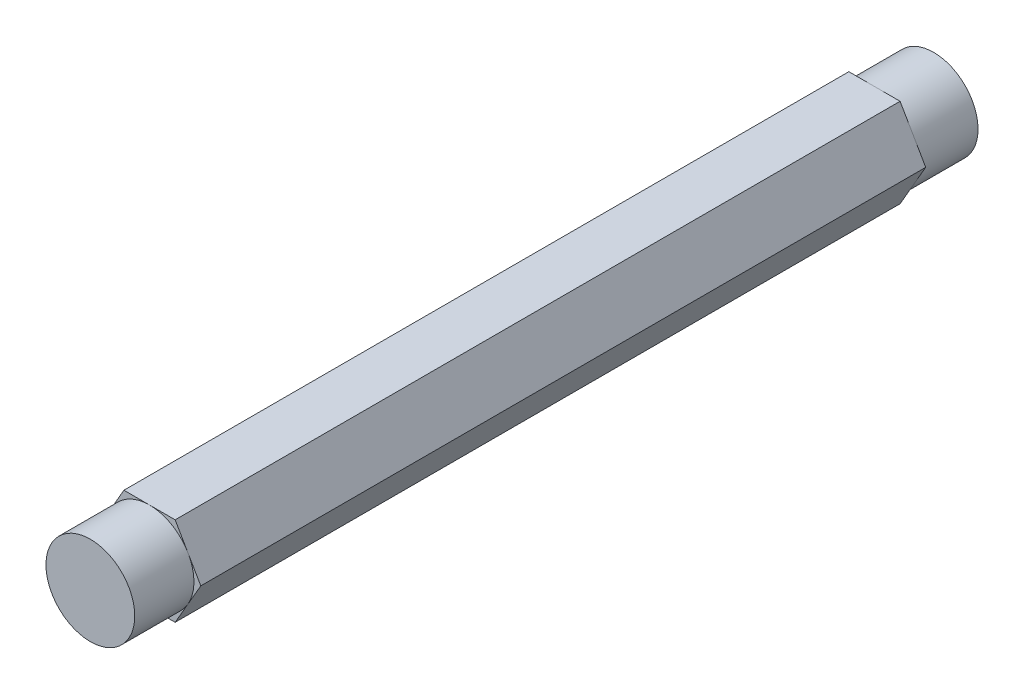
ISO-10303-21;
HEADER;
FILE_DESCRIPTION(('STEP AP214'),'2;1');
FILE_NAME('part.step','',(''),(''),'','','');
FILE_SCHEMA(('AUTOMOTIVE_DESIGN { 1 0 10303 214 1 1 1 1 }'));
ENDSEC;
DATA;
#1=APPLICATION_CONTEXT('core data for automotive mechanical design processes');
#2=APPLICATION_PROTOCOL_DEFINITION('international standard','automotive_design',2000,#1);
#3=PRODUCT_CONTEXT('',#1,'mechanical');
#4=PRODUCT('Part','Part','',(#3));
#5=PRODUCT_RELATED_PRODUCT_CATEGORY('part','',(#4));
#6=PRODUCT_DEFINITION_FORMATION('','',#4);
#7=PRODUCT_DEFINITION_CONTEXT('part definition',#1,'design');
#8=PRODUCT_DEFINITION('design','',#6,#7);
#9=PRODUCT_DEFINITION_SHAPE('','',#8);
#10=(LENGTH_UNIT() NAMED_UNIT(*) SI_UNIT(.MILLI.,.METRE.));
#11=(NAMED_UNIT(*) PLANE_ANGLE_UNIT() SI_UNIT($,.RADIAN.));
#12=(NAMED_UNIT(*) SI_UNIT($,.STERADIAN.) SOLID_ANGLE_UNIT());
#13=UNCERTAINTY_MEASURE_WITH_UNIT(LENGTH_MEASURE(1.E-05),#10,'distance_accuracy_value','');
#14=(GEOMETRIC_REPRESENTATION_CONTEXT(3) GLOBAL_UNCERTAINTY_ASSIGNED_CONTEXT((#13)) GLOBAL_UNIT_ASSIGNED_CONTEXT((#10,
#11,#12)) REPRESENTATION_CONTEXT('',''));
#15=CARTESIAN_POINT('',(0.,0.,0.));
#16=DIRECTION('',(0.,0.,1.));
#17=DIRECTION('',(1.,0.,0.));
#18=AXIS2_PLACEMENT_3D('',#15,#16,#17);
#19=CARTESIAN_POINT('',(0.,0.,0.));
#20=DIRECTION('',(0.,0.,1.));
#21=DIRECTION('',(1.,0.,0.));
#22=AXIS2_PLACEMENT_3D('',#19,#20,#21);
#23=PLANE('',#22);
#24=CARTESIAN_POINT('',(0.,0.,0.));
#25=DIRECTION('',(0.,0.,-1.));
#26=DIRECTION('',(-1.,0.,0.));
#27=AXIS2_PLACEMENT_3D('',#24,#25,#26);
#28=CIRCLE('',#27,4.7625);
#29=CARTESIAN_POINT('',(-4.12444598552339,2.38125,0.));
#30=VERTEX_POINT('',#29);
#31=CARTESIAN_POINT('',(0.,4.7625,0.));
#32=VERTEX_POINT('',#31);
#33=EDGE_CURVE('E46',#30,#32,#28,.T.);
#34=ORIENTED_EDGE('',*,*,#33,.F.);
#35=DIRECTION('',(-0.5,-0.866025403784439,0.));
#36=VECTOR('',#35,1.);
#37=CARTESIAN_POINT('',(-2.74963065701559,4.7625,0.));
#38=LINE('',#37,#36);
#39=CARTESIAN_POINT('',(-2.74963065701559,4.7625,0.));
#40=VERTEX_POINT('',#39);
#41=EDGE_CURVE('E130',#40,#30,#38,.T.);
#42=ORIENTED_EDGE('',*,*,#41,.F.);
#43=DIRECTION('',(-1.,0.,0.));
#44=VECTOR('',#43,1.);
#45=CARTESIAN_POINT('',(2.74963065701559,4.7625,0.));
#46=LINE('',#45,#44);
#47=EDGE_CURVE('E153',#32,#40,#46,.T.);
#48=ORIENTED_EDGE('',*,*,#47,.F.);
#49=EDGE_LOOP('',(#34,#42,#48));
#50=FACE_BOUND('',#49,.T.);
#51=ADVANCED_FACE('F35',(#50),#23,.F.);
#52=CARTESIAN_POINT('',(4.12444598552339,2.38125,0.));
#53=VERTEX_POINT('',#52);
#54=EDGE_CURVE('E11',#32,#53,#28,.T.);
#55=ORIENTED_EDGE('',*,*,#54,.F.);
#56=CARTESIAN_POINT('',(2.74963065701559,4.7625,0.));
#57=VERTEX_POINT('',#56);
#58=EDGE_CURVE('E151',#57,#32,#46,.T.);
#59=ORIENTED_EDGE('',*,*,#58,.F.);
#60=DIRECTION('',(-0.5,0.866025403784439,0.));
#61=VECTOR('',#60,1.);
#62=CARTESIAN_POINT('',(5.49926131403119,0.,0.));
#63=LINE('',#62,#61);
#64=EDGE_CURVE('E203',#53,#57,#63,.T.);
#65=ORIENTED_EDGE('',*,*,#64,.F.);
#66=EDGE_LOOP('',(#55,#59,#65));
#67=FACE_BOUND('',#66,.T.);
#68=ADVANCED_FACE('F246',(#67),#23,.F.);
#69=CARTESIAN_POINT('',(4.12444598552339,-2.38125,0.));
#70=VERTEX_POINT('',#69);
#71=EDGE_CURVE('E44',#53,#70,#28,.T.);
#72=ORIENTED_EDGE('',*,*,#71,.F.);
#73=CARTESIAN_POINT('',(5.49926131403119,0.,0.));
#74=VERTEX_POINT('',#73);
#75=EDGE_CURVE('E204',#74,#53,#63,.T.);
#76=ORIENTED_EDGE('',*,*,#75,.F.);
#77=DIRECTION('',(0.5,0.866025403784439,0.));
#78=VECTOR('',#77,1.);
#79=CARTESIAN_POINT('',(2.74963065701559,-4.7625,0.));
#80=LINE('',#79,#78);
#81=EDGE_CURVE('E199',#70,#74,#80,.T.);
#82=ORIENTED_EDGE('',*,*,#81,.F.);
#83=EDGE_LOOP('',(#72,#76,#82));
#84=FACE_BOUND('',#83,.T.);
#85=ADVANCED_FACE('F250',(#84),#23,.F.);
#86=CARTESIAN_POINT('',(0.,-4.7625,0.));
#87=VERTEX_POINT('',#86);
#88=EDGE_CURVE('E60',#70,#87,#28,.T.);
#89=ORIENTED_EDGE('',*,*,#88,.F.);
#90=CARTESIAN_POINT('',(2.74963065701559,-4.7625,0.));
#91=VERTEX_POINT('',#90);
#92=EDGE_CURVE('E200',#91,#70,#80,.T.);
#93=ORIENTED_EDGE('',*,*,#92,.F.);
#94=DIRECTION('',(1.,0.,0.));
#95=VECTOR('',#94,1.);
#96=CARTESIAN_POINT('',(-2.74963065701559,-4.7625,0.));
#97=LINE('',#96,#95);
#98=EDGE_CURVE('E195',#87,#91,#97,.T.);
#99=ORIENTED_EDGE('',*,*,#98,.F.);
#100=EDGE_LOOP('',(#89,#93,#99));
#101=FACE_BOUND('',#100,.T.);
#102=ADVANCED_FACE('F253',(#101),#23,.F.);
#103=CARTESIAN_POINT('',(-4.12444598552339,-2.38125,0.));
#104=VERTEX_POINT('',#103);
#105=EDGE_CURVE('E53',#87,#104,#28,.T.);
#106=ORIENTED_EDGE('',*,*,#105,.F.);
#107=CARTESIAN_POINT('',(-2.74963065701559,-4.7625,0.));
#108=VERTEX_POINT('',#107);
#109=EDGE_CURVE('E196',#108,#87,#97,.T.);
#110=ORIENTED_EDGE('',*,*,#109,.F.);
#111=DIRECTION('',(0.5,-0.866025403784439,0.));
#112=VECTOR('',#111,1.);
#113=CARTESIAN_POINT('',(-5.49926131403119,0.,0.));
#114=LINE('',#113,#112);
#115=EDGE_CURVE('E167',#104,#108,#114,.T.);
#116=ORIENTED_EDGE('',*,*,#115,.F.);
#117=EDGE_LOOP('',(#106,#110,#116));
#118=FACE_BOUND('',#117,.T.);
#119=ADVANCED_FACE('F255',(#118),#23,.F.);
#120=CARTESIAN_POINT('',(0.,0.,77.7875));
#121=DIRECTION('',(0.,0.,1.));
#122=DIRECTION('',(1.,0.,0.));
#123=AXIS2_PLACEMENT_3D('',#120,#121,#122);
#124=PLANE('',#123);
#125=CARTESIAN_POINT('',(0.,0.,77.7875));
#126=DIRECTION('',(0.,0.,1.));
#127=DIRECTION('',(1.,0.,0.));
#128=AXIS2_PLACEMENT_3D('',#125,#126,#127);
#129=CIRCLE('',#128,4.7625);
#130=CARTESIAN_POINT('',(4.12444598552339,2.38125,77.7875));
#131=VERTEX_POINT('',#130);
#132=CARTESIAN_POINT('',(0.,4.7625,77.7875));
#133=VERTEX_POINT('',#132);
#134=EDGE_CURVE('E162',#131,#133,#129,.T.);
#135=ORIENTED_EDGE('',*,*,#134,.F.);
#136=DIRECTION('',(-0.5,0.866025403784439,0.));
#137=VECTOR('',#136,1.);
#138=CARTESIAN_POINT('',(5.49926131403119,0.,77.7875));
#139=LINE('',#138,#137);
#140=CARTESIAN_POINT('',(2.74963065701559,4.7625,77.7875));
#141=VERTEX_POINT('',#140);
#142=EDGE_CURVE('E182',#131,#141,#139,.T.);
#143=ORIENTED_EDGE('',*,*,#142,.T.);
#144=DIRECTION('',(-1.,0.,0.));
#145=VECTOR('',#144,1.);
#146=CARTESIAN_POINT('',(2.74963065701559,4.7625,77.7875));
#147=LINE('',#146,#145);
#148=EDGE_CURVE('E186',#141,#133,#147,.T.);
#149=ORIENTED_EDGE('',*,*,#148,.T.);
#150=EDGE_LOOP('',(#135,#143,#149));
#151=FACE_BOUND('',#150,.T.);
#152=ADVANCED_FACE('F272',(#151),#124,.T.);
#153=CARTESIAN_POINT('',(-4.12444598552339,2.38125,77.7875));
#154=VERTEX_POINT('',#153);
#155=EDGE_CURVE('E158',#133,#154,#129,.T.);
#156=ORIENTED_EDGE('',*,*,#155,.F.);
#157=CARTESIAN_POINT('',(-2.74963065701559,4.7625,77.7875));
#158=VERTEX_POINT('',#157);
#159=EDGE_CURVE('E185',#133,#158,#147,.T.);
#160=ORIENTED_EDGE('',*,*,#159,.T.);
#161=DIRECTION('',(-0.5,-0.866025403784439,0.));
#162=VECTOR('',#161,1.);
#163=CARTESIAN_POINT('',(-2.74963065701559,4.7625,77.7875));
#164=LINE('',#163,#162);
#165=EDGE_CURVE('E190',#158,#154,#164,.T.);
#166=ORIENTED_EDGE('',*,*,#165,.T.);
#167=EDGE_LOOP('',(#156,#160,#166));
#168=FACE_BOUND('',#167,.T.);
#169=ADVANCED_FACE('F237',(#168),#124,.T.);
#170=CARTESIAN_POINT('',(-4.12444598552339,-2.38125,77.7875));
#171=VERTEX_POINT('',#170);
#172=EDGE_CURVE('E160',#154,#171,#129,.T.);
#173=ORIENTED_EDGE('',*,*,#172,.F.);
#174=CARTESIAN_POINT('',(-5.49926131403119,0.,77.7875));
#175=VERTEX_POINT('',#174);
#176=EDGE_CURVE('E189',#154,#175,#164,.T.);
#177=ORIENTED_EDGE('',*,*,#176,.T.);
#178=DIRECTION('',(0.5,-0.866025403784439,0.));
#179=VECTOR('',#178,1.);
#180=CARTESIAN_POINT('',(-5.49926131403119,0.,77.7875));
#181=LINE('',#180,#179);
#182=EDGE_CURVE('E171',#175,#171,#181,.T.);
#183=ORIENTED_EDGE('',*,*,#182,.T.);
#184=EDGE_LOOP('',(#173,#177,#183));
#185=FACE_BOUND('',#184,.T.);
#186=ADVANCED_FACE('F234',(#185),#124,.T.);
#187=CARTESIAN_POINT('',(0.,-4.7625,77.7875));
#188=VERTEX_POINT('',#187);
#189=EDGE_CURVE('E228',#171,#188,#129,.T.);
#190=ORIENTED_EDGE('',*,*,#189,.F.);
#191=CARTESIAN_POINT('',(-2.74963065701559,-4.7625,77.7875));
#192=VERTEX_POINT('',#191);
#193=EDGE_CURVE('E142',#171,#192,#181,.T.);
#194=ORIENTED_EDGE('',*,*,#193,.T.);
#195=DIRECTION('',(1.,0.,0.));
#196=VECTOR('',#195,1.);
#197=CARTESIAN_POINT('',(-2.74963065701559,-4.7625,77.7875));
#198=LINE('',#197,#196);
#199=EDGE_CURVE('E175',#192,#188,#198,.T.);
#200=ORIENTED_EDGE('',*,*,#199,.T.);
#201=EDGE_LOOP('',(#190,#194,#200));
#202=FACE_BOUND('',#201,.T.);
#203=ADVANCED_FACE('F259',(#202),#124,.T.);
#204=CARTESIAN_POINT('',(4.12444598552339,-2.38125,77.7875));
#205=VERTEX_POINT('',#204);
#206=EDGE_CURVE('E225',#188,#205,#129,.T.);
#207=ORIENTED_EDGE('',*,*,#206,.F.);
#208=CARTESIAN_POINT('',(2.74963065701559,-4.7625,77.7875));
#209=VERTEX_POINT('',#208);
#210=EDGE_CURVE('E174',#188,#209,#198,.T.);
#211=ORIENTED_EDGE('',*,*,#210,.T.);
#212=DIRECTION('',(0.5,0.866025403784439,0.));
#213=VECTOR('',#212,1.);
#214=CARTESIAN_POINT('',(2.74963065701559,-4.7625,77.7875));
#215=LINE('',#214,#213);
#216=EDGE_CURVE('E179',#209,#205,#215,.T.);
#217=ORIENTED_EDGE('',*,*,#216,.T.);
#218=EDGE_LOOP('',(#207,#211,#217));
#219=FACE_BOUND('',#218,.T.);
#220=ADVANCED_FACE('F262',(#219),#124,.T.);
#221=CARTESIAN_POINT('',(-5.49926131403119,0.,77.7875));
#222=DIRECTION('',(0.866025403784439,0.5,0.));
#223=DIRECTION('',(-0.5,0.866025403784439,0.));
#224=AXIS2_PLACEMENT_3D('',#221,#222,#223);
#225=PLANE('',#224);
#226=CARTESIAN_POINT('',(-5.49926131403119,0.,0.));
#227=VERTEX_POINT('',#226);
#228=EDGE_CURVE('E150',#227,#104,#114,.T.);
#229=ORIENTED_EDGE('',*,*,#228,.T.);
#230=ORIENTED_EDGE('',*,*,#115,.T.);
#231=DIRECTION('',(0.,0.,-1.));
#232=VECTOR('',#231,1.);
#233=CARTESIAN_POINT('',(-2.74963065701559,-4.7625,77.7875));
#234=LINE('',#233,#232);
#235=EDGE_CURVE('E39',#192,#108,#234,.T.);
#236=ORIENTED_EDGE('',*,*,#235,.F.);
#237=ORIENTED_EDGE('',*,*,#193,.F.);
#238=ORIENTED_EDGE('',*,*,#182,.F.);
#239=DIRECTION('',(0.,0.,-1.));
#240=VECTOR('',#239,1.);
#241=CARTESIAN_POINT('',(-5.49926131403119,0.,77.7875));
#242=LINE('',#241,#240);
#243=EDGE_CURVE('E193',#175,#227,#242,.T.);
#244=ORIENTED_EDGE('',*,*,#243,.T.);
#245=EDGE_LOOP('',(#229,#230,#236,#237,#238,#244));
#246=FACE_BOUND('',#245,.T.);
#247=ADVANCED_FACE('F37',(#246),#225,.F.);
#248=CARTESIAN_POINT('',(-2.74963065701559,-4.7625,77.7875));
#249=DIRECTION('',(0.,1.,0.));
#250=DIRECTION('',(-1.,0.,0.));
#251=AXIS2_PLACEMENT_3D('',#248,#249,#250);
#252=PLANE('',#251);
#253=ORIENTED_EDGE('',*,*,#109,.T.);
#254=ORIENTED_EDGE('',*,*,#98,.T.);
#255=DIRECTION('',(0.,0.,-1.));
#256=VECTOR('',#255,1.);
#257=CARTESIAN_POINT('',(2.74963065701559,-4.7625,77.7875));
#258=LINE('',#257,#256);
#259=EDGE_CURVE('E215',#209,#91,#258,.T.);
#260=ORIENTED_EDGE('',*,*,#259,.F.);
#261=ORIENTED_EDGE('',*,*,#210,.F.);
#262=ORIENTED_EDGE('',*,*,#199,.F.);
#263=ORIENTED_EDGE('',*,*,#235,.T.);
#264=EDGE_LOOP('',(#253,#254,#260,#261,#262,#263));
#265=FACE_BOUND('',#264,.T.);
#266=ADVANCED_FACE('F254',(#265),#252,.F.);
#267=CARTESIAN_POINT('',(2.74963065701559,-4.7625,77.7875));
#268=DIRECTION('',(-0.866025403784439,0.5,0.));
#269=DIRECTION('',(-0.5,-0.866025403784439,0.));
#270=AXIS2_PLACEMENT_3D('',#267,#268,#269);
#271=PLANE('',#270);
#272=ORIENTED_EDGE('',*,*,#92,.T.);
#273=ORIENTED_EDGE('',*,*,#81,.T.);
#274=DIRECTION('',(0.,0.,-1.));
#275=VECTOR('',#274,1.);
#276=CARTESIAN_POINT('',(5.49926131403119,0.,77.7875));
#277=LINE('',#276,#275);
#278=CARTESIAN_POINT('',(5.49926131403119,0.,77.7875));
#279=VERTEX_POINT('',#278);
#280=EDGE_CURVE('E213',#279,#74,#277,.T.);
#281=ORIENTED_EDGE('',*,*,#280,.F.);
#282=EDGE_CURVE('E178',#205,#279,#215,.T.);
#283=ORIENTED_EDGE('',*,*,#282,.F.);
#284=ORIENTED_EDGE('',*,*,#216,.F.);
#285=ORIENTED_EDGE('',*,*,#259,.T.);
#286=EDGE_LOOP('',(#272,#273,#281,#283,#284,#285));
#287=FACE_BOUND('',#286,.T.);
#288=ADVANCED_FACE('F252',(#287),#271,.F.);
#289=CARTESIAN_POINT('',(5.49926131403119,0.,77.7875));
#290=DIRECTION('',(-0.866025403784439,-0.5,0.));
#291=DIRECTION('',(0.5,-0.866025403784439,0.));
#292=AXIS2_PLACEMENT_3D('',#289,#290,#291);
#293=PLANE('',#292);
#294=ORIENTED_EDGE('',*,*,#75,.T.);
#295=ORIENTED_EDGE('',*,*,#64,.T.);
#296=DIRECTION('',(0.,0.,-1.));
#297=VECTOR('',#296,1.);
#298=CARTESIAN_POINT('',(2.74963065701559,4.7625,77.7875));
#299=LINE('',#298,#297);
#300=EDGE_CURVE('E210',#141,#57,#299,.T.);
#301=ORIENTED_EDGE('',*,*,#300,.F.);
#302=ORIENTED_EDGE('',*,*,#142,.F.);
#303=EDGE_CURVE('E183',#279,#131,#139,.T.);
#304=ORIENTED_EDGE('',*,*,#303,.F.);
#305=ORIENTED_EDGE('',*,*,#280,.T.);
#306=EDGE_LOOP('',(#294,#295,#301,#302,#304,#305));
#307=FACE_BOUND('',#306,.T.);
#308=ADVANCED_FACE('F270',(#307),#293,.F.);
#309=CARTESIAN_POINT('',(2.74963065701559,4.7625,77.7875));
#310=DIRECTION('',(0.,-1.,0.));
#311=DIRECTION('',(1.,0.,0.));
#312=AXIS2_PLACEMENT_3D('',#309,#310,#311);
#313=PLANE('',#312);
#314=ORIENTED_EDGE('',*,*,#58,.T.);
#315=ORIENTED_EDGE('',*,*,#47,.T.);
#316=DIRECTION('',(0.,0.,-1.));
#317=VECTOR('',#316,1.);
#318=CARTESIAN_POINT('',(-2.74963065701559,4.7625,77.7875));
#319=LINE('',#318,#317);
#320=EDGE_CURVE('E138',#158,#40,#319,.T.);
#321=ORIENTED_EDGE('',*,*,#320,.F.);
#322=ORIENTED_EDGE('',*,*,#159,.F.);
#323=ORIENTED_EDGE('',*,*,#148,.F.);
#324=ORIENTED_EDGE('',*,*,#300,.T.);
#325=EDGE_LOOP('',(#314,#315,#321,#322,#323,#324));
#326=FACE_BOUND('',#325,.T.);
#327=ADVANCED_FACE('F241',(#326),#313,.F.);
#328=CARTESIAN_POINT('',(-2.74963065701559,4.7625,77.7875));
#329=DIRECTION('',(0.866025403784439,-0.5,0.));
#330=DIRECTION('',(0.5,0.866025403784439,0.));
#331=AXIS2_PLACEMENT_3D('',#328,#329,#330);
#332=PLANE('',#331);
#333=ORIENTED_EDGE('',*,*,#41,.T.);
#334=EDGE_CURVE('E134',#30,#227,#38,.T.);
#335=ORIENTED_EDGE('',*,*,#334,.T.);
#336=ORIENTED_EDGE('',*,*,#243,.F.);
#337=ORIENTED_EDGE('',*,*,#176,.F.);
#338=ORIENTED_EDGE('',*,*,#165,.F.);
#339=ORIENTED_EDGE('',*,*,#320,.T.);
#340=EDGE_LOOP('',(#333,#335,#336,#337,#338,#339));
#341=FACE_BOUND('',#340,.T.);
#342=ADVANCED_FACE('F132',(#341),#332,.F.);
#343=EDGE_CURVE('E170',#205,#131,#129,.T.);
#344=ORIENTED_EDGE('',*,*,#343,.F.);
#345=ORIENTED_EDGE('',*,*,#282,.T.);
#346=ORIENTED_EDGE('',*,*,#303,.T.);
#347=EDGE_LOOP('',(#344,#345,#346));
#348=FACE_BOUND('',#347,.T.);
#349=ADVANCED_FACE('F266',(#348),#124,.T.);
#350=EDGE_CURVE('E148',#104,#30,#28,.T.);
#351=ORIENTED_EDGE('',*,*,#350,.F.);
#352=ORIENTED_EDGE('',*,*,#228,.F.);
#353=ORIENTED_EDGE('',*,*,#334,.F.);
#354=EDGE_LOOP('',(#351,#352,#353));
#355=FACE_BOUND('',#354,.T.);
#356=ADVANCED_FACE('F146',(#355),#23,.F.);
#357=CARTESIAN_POINT('',(0.,0.,84.1375));
#358=DIRECTION('',(0.,0.,-1.));
#359=DIRECTION('',(-1.,0.,0.));
#360=AXIS2_PLACEMENT_3D('',#357,#358,#359);
#361=CYLINDRICAL_SURFACE('',#360,4.7625);
#362=CARTESIAN_POINT('',(0.,0.,84.1375));
#363=DIRECTION('',(0.,0.,1.));
#364=DIRECTION('',(1.,0.,0.));
#365=AXIS2_PLACEMENT_3D('',#362,#363,#364);
#366=CIRCLE('',#365,4.7625);
#367=CARTESIAN_POINT('',(4.7625,0.,84.1375));
#368=VERTEX_POINT('',#367);
#369=EDGE_CURVE('E165',#368,#368,#366,.T.);
#370=ORIENTED_EDGE('',*,*,#369,.F.);
#371=EDGE_LOOP('',(#370));
#372=FACE_BOUND('',#371,.T.);
#373=ORIENTED_EDGE('',*,*,#134,.T.);
#374=ORIENTED_EDGE('',*,*,#155,.T.);
#375=ORIENTED_EDGE('',*,*,#172,.T.);
#376=ORIENTED_EDGE('',*,*,#189,.T.);
#377=ORIENTED_EDGE('',*,*,#206,.T.);
#378=ORIENTED_EDGE('',*,*,#343,.T.);
#379=EDGE_LOOP('',(#373,#374,#375,#376,#377,#378));
#380=FACE_BOUND('',#379,.T.);
#381=ADVANCED_FACE('F231',(#372,#380),#361,.T.);
#382=CARTESIAN_POINT('',(0.,0.,84.1375));
#383=DIRECTION('',(0.,0.,1.));
#384=DIRECTION('',(1.,0.,0.));
#385=AXIS2_PLACEMENT_3D('',#382,#383,#384);
#386=PLANE('',#385);
#387=ORIENTED_EDGE('',*,*,#369,.T.);
#388=EDGE_LOOP('',(#387));
#389=FACE_BOUND('',#388,.T.);
#390=ADVANCED_FACE('F291',(#389),#386,.T.);
#391=CARTESIAN_POINT('',(0.,0.,-6.35));
#392=DIRECTION('',(0.,0.,1.));
#393=DIRECTION('',(1.,0.,0.));
#394=AXIS2_PLACEMENT_3D('',#391,#392,#393);
#395=CYLINDRICAL_SURFACE('',#394,4.7625);
#396=CARTESIAN_POINT('',(0.,0.,-6.35));
#397=DIRECTION('',(0.,0.,-1.));
#398=DIRECTION('',(-1.,0.,0.));
#399=AXIS2_PLACEMENT_3D('',#396,#397,#398);
#400=CIRCLE('',#399,4.7625);
#401=CARTESIAN_POINT('',(-4.7625,0.,-6.35));
#402=VERTEX_POINT('',#401);
#403=EDGE_CURVE('E156',#402,#402,#400,.T.);
#404=ORIENTED_EDGE('',*,*,#403,.F.);
#405=EDGE_LOOP('',(#404));
#406=FACE_BOUND('',#405,.T.);
#407=ORIENTED_EDGE('',*,*,#33,.T.);
#408=ORIENTED_EDGE('',*,*,#54,.T.);
#409=ORIENTED_EDGE('',*,*,#71,.T.);
#410=ORIENTED_EDGE('',*,*,#88,.T.);
#411=ORIENTED_EDGE('',*,*,#105,.T.);
#412=ORIENTED_EDGE('',*,*,#350,.T.);
#413=EDGE_LOOP('',(#407,#408,#409,#410,#411,#412));
#414=FACE_BOUND('',#413,.T.);
#415=ADVANCED_FACE('F157',(#406,#414),#395,.T.);
#416=CARTESIAN_POINT('',(0.,0.,-6.35));
#417=DIRECTION('',(0.,0.,-1.));
#418=DIRECTION('',(-1.,0.,0.));
#419=AXIS2_PLACEMENT_3D('',#416,#417,#418);
#420=PLANE('',#419);
#421=ORIENTED_EDGE('',*,*,#403,.T.);
#422=EDGE_LOOP('',(#421));
#423=FACE_BOUND('',#422,.T.);
#424=ADVANCED_FACE('F302',(#423),#420,.T.);
#425=CLOSED_SHELL('',(#51,#68,#85,#102,#119,#152,#169,#186,#203,#220,#247,#266,#288,#308,#327,
#342,#349,#356,#381,#390,#415,#424));
#426=MANIFOLD_SOLID_BREP('B2',#425);
#427=ADVANCED_BREP_SHAPE_REPRESENTATION('',(#18,#426),#14);
#428=SHAPE_DEFINITION_REPRESENTATION(#9,#427);
ENDSEC;
END-ISO-10303-21;
